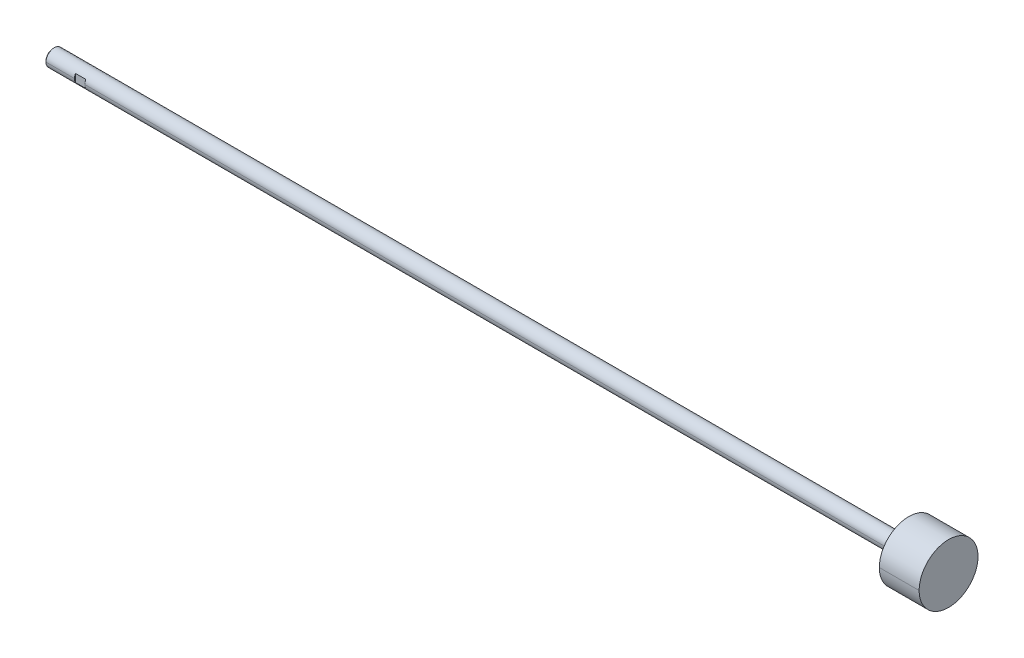
ISO-10303-21;
HEADER;
FILE_DESCRIPTION(('STEP AP214'),'2;1');
FILE_NAME('part.step','',(''),(''),'','','');
FILE_SCHEMA(('AUTOMOTIVE_DESIGN { 1 0 10303 214 1 1 1 1 }'));
ENDSEC;
DATA;
#1=APPLICATION_CONTEXT('core data for automotive mechanical design processes');
#2=APPLICATION_PROTOCOL_DEFINITION('international standard','automotive_design',2000,#1);
#3=PRODUCT_CONTEXT('',#1,'mechanical');
#4=PRODUCT('Part','Part','',(#3));
#5=PRODUCT_RELATED_PRODUCT_CATEGORY('part','',(#4));
#6=PRODUCT_DEFINITION_FORMATION('','',#4);
#7=PRODUCT_DEFINITION_CONTEXT('part definition',#1,'design');
#8=PRODUCT_DEFINITION('design','',#6,#7);
#9=PRODUCT_DEFINITION_SHAPE('','',#8);
#10=(LENGTH_UNIT() NAMED_UNIT(*) SI_UNIT(.MILLI.,.METRE.));
#11=(NAMED_UNIT(*) PLANE_ANGLE_UNIT() SI_UNIT($,.RADIAN.));
#12=(NAMED_UNIT(*) SI_UNIT($,.STERADIAN.) SOLID_ANGLE_UNIT());
#13=UNCERTAINTY_MEASURE_WITH_UNIT(LENGTH_MEASURE(1.E-05),#10,'distance_accuracy_value','');
#14=(GEOMETRIC_REPRESENTATION_CONTEXT(3) GLOBAL_UNCERTAINTY_ASSIGNED_CONTEXT((#13)) GLOBAL_UNIT_ASSIGNED_CONTEXT((#10,
#11,#12)) REPRESENTATION_CONTEXT('',''));
#15=CARTESIAN_POINT('',(0.,0.,0.));
#16=DIRECTION('',(0.,0.,1.));
#17=DIRECTION('',(1.,0.,0.));
#18=AXIS2_PLACEMENT_3D('',#15,#16,#17);
#19=CARTESIAN_POINT('',(0.,-6.35,-5.588));
#20=DIRECTION('',(0.,0.,1.));
#21=DIRECTION('',(1.,0.,0.));
#22=AXIS2_PLACEMENT_3D('',#19,#20,#21);
#23=PLANE('',#22);
#24=DIRECTION('',(0.,1.,0.));
#25=VECTOR('',#24,1.);
#26=CARTESIAN_POINT('',(-7.874,-6.35,-5.588));
#27=LINE('',#26,#25);
#28=CARTESIAN_POINT('',(-7.87400000000005,-3.01608289010763,-5.588));
#29=VERTEX_POINT('',#28);
#30=CARTESIAN_POINT('',(-7.87400000000005,3.01608289010763,-5.588));
#31=VERTEX_POINT('',#30);
#32=EDGE_CURVE('E11',#29,#31,#27,.T.);
#33=ORIENTED_EDGE('',*,*,#32,.T.);
#34=DIRECTION('',(1.,0.,0.));
#35=VECTOR('',#34,1.);
#36=CARTESIAN_POINT('',(649.351,3.01608289010763,-5.588));
#37=LINE('',#36,#35);
#38=CARTESIAN_POINT('',(0.,3.01608289010763,-5.588));
#39=VERTEX_POINT('',#38);
#40=EDGE_CURVE('E25',#31,#39,#37,.T.);
#41=ORIENTED_EDGE('',*,*,#40,.T.);
#42=DIRECTION('',(0.,1.,0.));
#43=VECTOR('',#42,1.);
#44=CARTESIAN_POINT('',(0.,-6.35,-5.588));
#45=LINE('',#44,#43);
#46=CARTESIAN_POINT('',(0.,-3.01608289010763,-5.588));
#47=VERTEX_POINT('',#46);
#48=EDGE_CURVE('E246',#47,#39,#45,.T.);
#49=ORIENTED_EDGE('',*,*,#48,.F.);
#50=DIRECTION('',(1.,0.,0.));
#51=VECTOR('',#50,1.);
#52=CARTESIAN_POINT('',(649.351,-3.01608289010763,-5.588));
#53=LINE('',#52,#51);
#54=EDGE_CURVE('E241',#29,#47,#53,.T.);
#55=ORIENTED_EDGE('',*,*,#54,.F.);
#56=EDGE_LOOP('',(#33,#41,#49,#55));
#57=FACE_BOUND('',#56,.T.);
#58=ADVANCED_FACE('F17',(#57),#23,.F.);
#59=CARTESIAN_POINT('',(649.351,0.,0.));
#60=DIRECTION('',(-1.,0.,0.));
#61=DIRECTION('',(0.,1.,0.));
#62=AXIS2_PLACEMENT_3D('',#59,#60,#61);
#63=CYLINDRICAL_SURFACE('',#62,6.35);
#64=CARTESIAN_POINT('',(-29.47035,0.,0.));
#65=DIRECTION('',(1.,0.,0.));
#66=DIRECTION('',(0.,0.,-1.));
#67=AXIS2_PLACEMENT_3D('',#64,#65,#66);
#68=CIRCLE('',#67,6.35);
#69=CARTESIAN_POINT('',(-29.4703500000001,0.,6.35));
#70=VERTEX_POINT('',#69);
#71=CARTESIAN_POINT('',(-29.47035,0.,-6.35));
#72=VERTEX_POINT('',#71);
#73=EDGE_CURVE('E237',#70,#72,#68,.T.);
#74=ORIENTED_EDGE('',*,*,#73,.T.);
#75=DIRECTION('',(-1.,0.,0.));
#76=VECTOR('',#75,1.);
#77=CARTESIAN_POINT('',(-7.87400000000002,0.,-6.35));
#78=LINE('',#77,#76);
#79=CARTESIAN_POINT('',(-7.87400000000002,0.,-6.35));
#80=VERTEX_POINT('',#79);
#81=EDGE_CURVE('E232',#80,#72,#78,.T.);
#82=ORIENTED_EDGE('',*,*,#81,.F.);
#83=CARTESIAN_POINT('',(-7.87400000000005,0.,0.));
#84=DIRECTION('',(1.,0.,0.));
#85=DIRECTION('',(0.,0.,-1.));
#86=AXIS2_PLACEMENT_3D('',#83,#84,#85);
#87=CIRCLE('',#86,6.35);
#88=EDGE_CURVE('E227',#29,#80,#87,.T.);
#89=ORIENTED_EDGE('',*,*,#88,.F.);
#90=ORIENTED_EDGE('',*,*,#54,.T.);
#91=CARTESIAN_POINT('',(0.,0.,0.));
#92=DIRECTION('',(1.,0.,0.));
#93=DIRECTION('',(0.,0.,-1.));
#94=AXIS2_PLACEMENT_3D('',#91,#92,#93);
#95=CIRCLE('',#94,6.35);
#96=CARTESIAN_POINT('',(0.,0.,-6.35));
#97=VERTEX_POINT('',#96);
#98=EDGE_CURVE('E223',#47,#97,#95,.T.);
#99=ORIENTED_EDGE('',*,*,#98,.T.);
#100=DIRECTION('',(-1.,0.,0.));
#101=VECTOR('',#100,1.);
#102=CARTESIAN_POINT('',(619.125,0.,-6.35));
#103=LINE('',#102,#101);
#104=CARTESIAN_POINT('',(619.125,0.,-6.35));
#105=VERTEX_POINT('',#104);
#106=EDGE_CURVE('E218',#105,#97,#103,.T.);
#107=ORIENTED_EDGE('',*,*,#106,.F.);
#108=CARTESIAN_POINT('',(619.125,0.,0.));
#109=DIRECTION('',(1.,0.,0.));
#110=DIRECTION('',(0.,0.,-1.));
#111=AXIS2_PLACEMENT_3D('',#108,#109,#110);
#112=CIRCLE('',#111,6.35);
#113=CARTESIAN_POINT('',(619.125,0.,6.35));
#114=VERTEX_POINT('',#113);
#115=EDGE_CURVE('E213',#114,#105,#112,.T.);
#116=ORIENTED_EDGE('',*,*,#115,.F.);
#117=DIRECTION('',(-1.,0.,0.));
#118=VECTOR('',#117,1.);
#119=CARTESIAN_POINT('',(619.125,0.,6.35));
#120=LINE('',#119,#118);
#121=CARTESIAN_POINT('',(0.,0.,6.35));
#122=VERTEX_POINT('',#121);
#123=EDGE_CURVE('E209',#114,#122,#120,.T.);
#124=ORIENTED_EDGE('',*,*,#123,.T.);
#125=CARTESIAN_POINT('',(0.,0.,0.));
#126=DIRECTION('',(1.,0.,0.));
#127=DIRECTION('',(0.,0.,-1.));
#128=AXIS2_PLACEMENT_3D('',#125,#126,#127);
#129=CIRCLE('',#128,6.35);
#130=CARTESIAN_POINT('',(0.,-3.01608289010763,5.588));
#131=VERTEX_POINT('',#130);
#132=EDGE_CURVE('E205',#122,#131,#129,.T.);
#133=ORIENTED_EDGE('',*,*,#132,.T.);
#134=DIRECTION('',(1.,0.,0.));
#135=VECTOR('',#134,1.);
#136=CARTESIAN_POINT('',(649.351,-3.01608289010763,5.588));
#137=LINE('',#136,#135);
#138=CARTESIAN_POINT('',(-7.87400000000005,-3.01608289010763,5.588));
#139=VERTEX_POINT('',#138);
#140=EDGE_CURVE('E200',#139,#131,#137,.T.);
#141=ORIENTED_EDGE('',*,*,#140,.F.);
#142=CARTESIAN_POINT('',(-7.87400000000005,0.,0.));
#143=DIRECTION('',(1.,0.,0.));
#144=DIRECTION('',(0.,0.,-1.));
#145=AXIS2_PLACEMENT_3D('',#142,#143,#144);
#146=CIRCLE('',#145,6.35);
#147=CARTESIAN_POINT('',(-7.87400000000002,0.,6.35));
#148=VERTEX_POINT('',#147);
#149=EDGE_CURVE('E195',#148,#139,#146,.T.);
#150=ORIENTED_EDGE('',*,*,#149,.F.);
#151=DIRECTION('',(-1.,0.,0.));
#152=VECTOR('',#151,1.);
#153=CARTESIAN_POINT('',(-7.87400000000002,0.,6.35));
#154=LINE('',#153,#152);
#155=EDGE_CURVE('E191',#148,#70,#154,.T.);
#156=ORIENTED_EDGE('',*,*,#155,.T.);
#157=EDGE_LOOP('',(#74,#82,#89,#90,#99,#107,#116,#124,#133,#141,#150,#156));
#158=FACE_BOUND('',#157,.T.);
#159=ADVANCED_FACE('F261',(#158),#63,.T.);
#160=CARTESIAN_POINT('',(649.351,0.,0.));
#161=DIRECTION('',(-1.,0.,0.));
#162=DIRECTION('',(0.,-1.,0.));
#163=AXIS2_PLACEMENT_3D('',#160,#161,#162);
#164=CYLINDRICAL_SURFACE('',#163,6.35);
#165=CARTESIAN_POINT('',(619.125,0.,0.));
#166=DIRECTION('',(1.,0.,0.));
#167=DIRECTION('',(0.,0.,-1.));
#168=AXIS2_PLACEMENT_3D('',#165,#166,#167);
#169=CIRCLE('',#168,6.35);
#170=EDGE_CURVE('E186',#105,#114,#169,.T.);
#171=ORIENTED_EDGE('',*,*,#170,.F.);
#172=ORIENTED_EDGE('',*,*,#106,.T.);
#173=CARTESIAN_POINT('',(0.,0.,0.));
#174=DIRECTION('',(1.,0.,0.));
#175=DIRECTION('',(0.,0.,-1.));
#176=AXIS2_PLACEMENT_3D('',#173,#174,#175);
#177=CIRCLE('',#176,6.35);
#178=EDGE_CURVE('E182',#97,#39,#177,.T.);
#179=ORIENTED_EDGE('',*,*,#178,.T.);
#180=ORIENTED_EDGE('',*,*,#40,.F.);
#181=CARTESIAN_POINT('',(-7.87400000000005,0.,0.));
#182=DIRECTION('',(1.,0.,0.));
#183=DIRECTION('',(0.,0.,-1.));
#184=AXIS2_PLACEMENT_3D('',#181,#182,#183);
#185=CIRCLE('',#184,6.35);
#186=EDGE_CURVE('E177',#80,#31,#185,.T.);
#187=ORIENTED_EDGE('',*,*,#186,.F.);
#188=ORIENTED_EDGE('',*,*,#81,.T.);
#189=CARTESIAN_POINT('',(-29.47035,0.,0.));
#190=DIRECTION('',(1.,0.,0.));
#191=DIRECTION('',(0.,0.,-1.));
#192=AXIS2_PLACEMENT_3D('',#189,#190,#191);
#193=CIRCLE('',#192,6.35);
#194=EDGE_CURVE('E172',#72,#70,#193,.T.);
#195=ORIENTED_EDGE('',*,*,#194,.T.);
#196=ORIENTED_EDGE('',*,*,#155,.F.);
#197=CARTESIAN_POINT('',(-7.87400000000005,0.,0.));
#198=DIRECTION('',(1.,0.,0.));
#199=DIRECTION('',(0.,0.,-1.));
#200=AXIS2_PLACEMENT_3D('',#197,#198,#199);
#201=CIRCLE('',#200,6.35);
#202=CARTESIAN_POINT('',(-7.87400000000005,3.01608289010763,5.588));
#203=VERTEX_POINT('',#202);
#204=EDGE_CURVE('E167',#203,#148,#201,.T.);
#205=ORIENTED_EDGE('',*,*,#204,.F.);
#206=DIRECTION('',(1.,0.,0.));
#207=VECTOR('',#206,1.);
#208=CARTESIAN_POINT('',(649.351,3.01608289010763,5.588));
#209=LINE('',#208,#207);
#210=CARTESIAN_POINT('',(0.,3.01608289010763,5.588));
#211=VERTEX_POINT('',#210);
#212=EDGE_CURVE('E163',#203,#211,#209,.T.);
#213=ORIENTED_EDGE('',*,*,#212,.T.);
#214=CARTESIAN_POINT('',(0.,0.,0.));
#215=DIRECTION('',(1.,0.,0.));
#216=DIRECTION('',(0.,0.,-1.));
#217=AXIS2_PLACEMENT_3D('',#214,#215,#216);
#218=CIRCLE('',#217,6.35);
#219=EDGE_CURVE('E158',#211,#122,#218,.T.);
#220=ORIENTED_EDGE('',*,*,#219,.T.);
#221=ORIENTED_EDGE('',*,*,#123,.F.);
#222=EDGE_LOOP('',(#171,#172,#179,#180,#187,#188,#195,#196,#205,#213,#220,#221));
#223=FACE_BOUND('',#222,.T.);
#224=ADVANCED_FACE('F267',(#223),#164,.T.);
#225=CARTESIAN_POINT('',(0.,0.,0.));
#226=DIRECTION('',(1.,0.,0.));
#227=DIRECTION('',(0.,0.,-1.));
#228=AXIS2_PLACEMENT_3D('',#225,#226,#227);
#229=PLANE('',#228);
#230=DIRECTION('',(0.,-1.,0.));
#231=VECTOR('',#230,1.);
#232=CARTESIAN_POINT('',(0.,6.35,5.588));
#233=LINE('',#232,#231);
#234=EDGE_CURVE('E153',#211,#131,#233,.T.);
#235=ORIENTED_EDGE('',*,*,#234,.T.);
#236=ORIENTED_EDGE('',*,*,#132,.F.);
#237=ORIENTED_EDGE('',*,*,#219,.F.);
#238=EDGE_LOOP('',(#235,#236,#237));
#239=FACE_BOUND('',#238,.T.);
#240=ADVANCED_FACE('F291',(#239),#229,.F.);
#241=CARTESIAN_POINT('',(0.,6.35,5.588));
#242=DIRECTION('',(0.,0.,-1.));
#243=DIRECTION('',(-1.,0.,0.));
#244=AXIS2_PLACEMENT_3D('',#241,#242,#243);
#245=PLANE('',#244);
#246=DIRECTION('',(0.,-1.,0.));
#247=VECTOR('',#246,1.);
#248=CARTESIAN_POINT('',(-7.874,6.35,5.588));
#249=LINE('',#248,#247);
#250=EDGE_CURVE('E148',#203,#139,#249,.T.);
#251=ORIENTED_EDGE('',*,*,#250,.T.);
#252=ORIENTED_EDGE('',*,*,#140,.T.);
#253=ORIENTED_EDGE('',*,*,#234,.F.);
#254=ORIENTED_EDGE('',*,*,#212,.F.);
#255=EDGE_LOOP('',(#251,#252,#253,#254));
#256=FACE_BOUND('',#255,.T.);
#257=ADVANCED_FACE('F296',(#256),#245,.F.);
#258=CARTESIAN_POINT('',(-7.874,0.,0.));
#259=DIRECTION('',(1.,0.,0.));
#260=DIRECTION('',(0.,0.,-1.));
#261=AXIS2_PLACEMENT_3D('',#258,#259,#260);
#262=PLANE('',#261);
#263=ORIENTED_EDGE('',*,*,#204,.T.);
#264=ORIENTED_EDGE('',*,*,#149,.T.);
#265=ORIENTED_EDGE('',*,*,#250,.F.);
#266=EDGE_LOOP('',(#263,#264,#265));
#267=FACE_BOUND('',#266,.T.);
#268=ADVANCED_FACE('F300',(#267),#262,.T.);
#269=CARTESIAN_POINT('',(-30.226,0.,0.));
#270=DIRECTION('',(1.,0.,0.));
#271=DIRECTION('',(0.,-1.,0.));
#272=AXIS2_PLACEMENT_3D('',#269,#270,#271);
#273=CONICAL_SURFACE('',#272,5.59435,0.7853981634);
#274=ORIENTED_EDGE('',*,*,#194,.F.);
#275=DIRECTION('',(0.707106781184744,0.,-0.707106781188351));
#276=VECTOR('',#275,1.);
#277=CARTESIAN_POINT('',(-30.226,0.,-5.59435));
#278=LINE('',#277,#276);
#279=CARTESIAN_POINT('',(-30.226,0.,-5.59435));
#280=VERTEX_POINT('',#279);
#281=EDGE_CURVE('E143',#280,#72,#278,.T.);
#282=ORIENTED_EDGE('',*,*,#281,.F.);
#283=CARTESIAN_POINT('',(-30.226,0.,0.));
#284=DIRECTION('',(1.,0.,0.));
#285=DIRECTION('',(0.,0.,-1.));
#286=AXIS2_PLACEMENT_3D('',#283,#284,#285);
#287=CIRCLE('',#286,5.59435);
#288=CARTESIAN_POINT('',(-30.226,0.,5.59435));
#289=VERTEX_POINT('',#288);
#290=EDGE_CURVE('E139',#280,#289,#287,.T.);
#291=ORIENTED_EDGE('',*,*,#290,.T.);
#292=DIRECTION('',(0.707106781184744,0.,0.707106781188351));
#293=VECTOR('',#292,1.);
#294=CARTESIAN_POINT('',(-30.226,0.,5.59435));
#295=LINE('',#294,#293);
#296=EDGE_CURVE('E134',#289,#70,#295,.T.);
#297=ORIENTED_EDGE('',*,*,#296,.T.);
#298=EDGE_LOOP('',(#274,#282,#291,#297));
#299=FACE_BOUND('',#298,.T.);
#300=ADVANCED_FACE('F304',(#299),#273,.T.);
#301=CARTESIAN_POINT('',(-30.226,0.,0.));
#302=DIRECTION('',(1.,0.,0.));
#303=DIRECTION('',(0.,1.,0.));
#304=AXIS2_PLACEMENT_3D('',#301,#302,#303);
#305=CONICAL_SURFACE('',#304,5.59435,0.7853981634);
#306=CARTESIAN_POINT('',(-30.226,0.,0.));
#307=DIRECTION('',(1.,0.,0.));
#308=DIRECTION('',(0.,0.,-1.));
#309=AXIS2_PLACEMENT_3D('',#306,#307,#308);
#310=CIRCLE('',#309,5.59435);
#311=EDGE_CURVE('E129',#289,#280,#310,.T.);
#312=ORIENTED_EDGE('',*,*,#311,.T.);
#313=ORIENTED_EDGE('',*,*,#281,.T.);
#314=ORIENTED_EDGE('',*,*,#73,.F.);
#315=ORIENTED_EDGE('',*,*,#296,.F.);
#316=EDGE_LOOP('',(#312,#313,#314,#315));
#317=FACE_BOUND('',#316,.T.);
#318=ADVANCED_FACE('F308',(#317),#305,.T.);
#319=CARTESIAN_POINT('',(-30.226,0.,0.));
#320=DIRECTION('',(1.,0.,0.));
#321=DIRECTION('',(0.,0.,-1.));
#322=AXIS2_PLACEMENT_3D('',#319,#320,#321);
#323=PLANE('',#322);
#324=ORIENTED_EDGE('',*,*,#290,.F.);
#325=ORIENTED_EDGE('',*,*,#311,.F.);
#326=EDGE_LOOP('',(#324,#325));
#327=FACE_BOUND('',#326,.T.);
#328=ADVANCED_FACE('F312',(#327),#323,.F.);
#329=CARTESIAN_POINT('',(-7.874,0.,0.));
#330=DIRECTION('',(1.,0.,0.));
#331=DIRECTION('',(0.,0.,-1.));
#332=AXIS2_PLACEMENT_3D('',#329,#330,#331);
#333=PLANE('',#332);
#334=ORIENTED_EDGE('',*,*,#88,.T.);
#335=ORIENTED_EDGE('',*,*,#186,.T.);
#336=ORIENTED_EDGE('',*,*,#32,.F.);
#337=EDGE_LOOP('',(#334,#335,#336));
#338=FACE_BOUND('',#337,.T.);
#339=ADVANCED_FACE('F264',(#338),#333,.T.);
#340=CARTESIAN_POINT('',(0.,0.,0.));
#341=DIRECTION('',(1.,0.,0.));
#342=DIRECTION('',(0.,0.,-1.));
#343=AXIS2_PLACEMENT_3D('',#340,#341,#342);
#344=PLANE('',#343);
#345=ORIENTED_EDGE('',*,*,#48,.T.);
#346=ORIENTED_EDGE('',*,*,#178,.F.);
#347=ORIENTED_EDGE('',*,*,#98,.F.);
#348=EDGE_LOOP('',(#345,#346,#347));
#349=FACE_BOUND('',#348,.T.);
#350=ADVANCED_FACE('F258',(#349),#344,.F.);
#351=CARTESIAN_POINT('',(619.125,6.35,0.));
#352=DIRECTION('',(1.,0.,0.));
#353=DIRECTION('',(0.,0.,-1.));
#354=AXIS2_PLACEMENT_3D('',#351,#352,#353);
#355=PLANE('',#354);
#356=CARTESIAN_POINT('',(619.125,0.,0.));
#357=DIRECTION('',(1.,0.,0.));
#358=DIRECTION('',(0.,0.,-1.));
#359=AXIS2_PLACEMENT_3D('',#356,#357,#358);
#360=CIRCLE('',#359,22.34565);
#361=CARTESIAN_POINT('',(619.125,0.,-22.34565));
#362=VERTEX_POINT('',#361);
#363=CARTESIAN_POINT('',(619.125,0.,22.34565));
#364=VERTEX_POINT('',#363);
#365=EDGE_CURVE('E110',#362,#364,#360,.T.);
#366=ORIENTED_EDGE('',*,*,#365,.F.);
#367=CARTESIAN_POINT('',(619.125,0.,0.));
#368=DIRECTION('',(1.,0.,0.));
#369=DIRECTION('',(0.,0.,-1.));
#370=AXIS2_PLACEMENT_3D('',#367,#368,#369);
#371=CIRCLE('',#370,22.34565);
#372=EDGE_CURVE('E122',#364,#362,#371,.T.);
#373=ORIENTED_EDGE('',*,*,#372,.F.);
#374=EDGE_LOOP('',(#366,#373));
#375=FACE_BOUND('',#374,.T.);
#376=ORIENTED_EDGE('',*,*,#170,.T.);
#377=ORIENTED_EDGE('',*,*,#115,.T.);
#378=EDGE_LOOP('',(#376,#377));
#379=FACE_BOUND('',#378,.T.);
#380=ADVANCED_FACE('F273',(#375,#379),#355,.F.);
#381=CARTESIAN_POINT('',(649.351,0.,0.));
#382=DIRECTION('',(-1.,0.,0.));
#383=DIRECTION('',(0.,1.,0.));
#384=AXIS2_PLACEMENT_3D('',#381,#382,#383);
#385=CYLINDRICAL_SURFACE('',#384,22.34565);
#386=ORIENTED_EDGE('',*,*,#372,.T.);
#387=DIRECTION('',(-1.,0.,0.));
#388=VECTOR('',#387,1.);
#389=CARTESIAN_POINT('',(649.351,0.,-22.34565));
#390=LINE('',#389,#388);
#391=CARTESIAN_POINT('',(649.351,0.,-22.34565));
#392=VERTEX_POINT('',#391);
#393=EDGE_CURVE('E102',#392,#362,#390,.T.);
#394=ORIENTED_EDGE('',*,*,#393,.F.);
#395=CARTESIAN_POINT('',(649.351,0.,0.));
#396=DIRECTION('',(1.,0.,0.));
#397=DIRECTION('',(0.,0.,-1.));
#398=AXIS2_PLACEMENT_3D('',#395,#396,#397);
#399=CIRCLE('',#398,22.34565);
#400=CARTESIAN_POINT('',(649.351,0.,22.34565));
#401=VERTEX_POINT('',#400);
#402=EDGE_CURVE('E95',#401,#392,#399,.T.);
#403=ORIENTED_EDGE('',*,*,#402,.F.);
#404=DIRECTION('',(-1.,0.,0.));
#405=VECTOR('',#404,1.);
#406=CARTESIAN_POINT('',(649.351,0.,22.34565));
#407=LINE('',#406,#405);
#408=EDGE_CURVE('E99',#401,#364,#407,.T.);
#409=ORIENTED_EDGE('',*,*,#408,.T.);
#410=EDGE_LOOP('',(#386,#394,#403,#409));
#411=FACE_BOUND('',#410,.T.);
#412=ADVANCED_FACE('F98',(#411),#385,.T.);
#413=CARTESIAN_POINT('',(649.351,0.,0.));
#414=DIRECTION('',(-1.,0.,0.));
#415=DIRECTION('',(0.,-1.,0.));
#416=AXIS2_PLACEMENT_3D('',#413,#414,#415);
#417=CYLINDRICAL_SURFACE('',#416,22.34565);
#418=CARTESIAN_POINT('',(649.351,0.,0.));
#419=DIRECTION('',(1.,0.,0.));
#420=DIRECTION('',(0.,0.,-1.));
#421=AXIS2_PLACEMENT_3D('',#418,#419,#420);
#422=CIRCLE('',#421,22.34565);
#423=EDGE_CURVE('E109',#392,#401,#422,.T.);
#424=ORIENTED_EDGE('',*,*,#423,.F.);
#425=ORIENTED_EDGE('',*,*,#393,.T.);
#426=ORIENTED_EDGE('',*,*,#365,.T.);
#427=ORIENTED_EDGE('',*,*,#408,.F.);
#428=EDGE_LOOP('',(#424,#425,#426,#427));
#429=FACE_BOUND('',#428,.T.);
#430=ADVANCED_FACE('F108',(#429),#417,.T.);
#431=CARTESIAN_POINT('',(649.351,22.34565,0.));
#432=DIRECTION('',(-1.,0.,0.));
#433=DIRECTION('',(0.,0.,1.));
#434=AXIS2_PLACEMENT_3D('',#431,#432,#433);
#435=PLANE('',#434);
#436=ORIENTED_EDGE('',*,*,#423,.T.);
#437=ORIENTED_EDGE('',*,*,#402,.T.);
#438=EDGE_LOOP('',(#436,#437));
#439=FACE_BOUND('',#438,.T.);
#440=ADVANCED_FACE('F112',(#439),#435,.F.);
#441=CLOSED_SHELL('',(#58,#159,#224,#240,#257,#268,#300,#318,#328,#339,#350,#380,#412,#430,#440));
#442=MANIFOLD_SOLID_BREP('B1',#441);
#443=ADVANCED_BREP_SHAPE_REPRESENTATION('',(#18,#442),#14);
#444=SHAPE_DEFINITION_REPRESENTATION(#9,#443);
ENDSEC;
END-ISO-10303-21;
